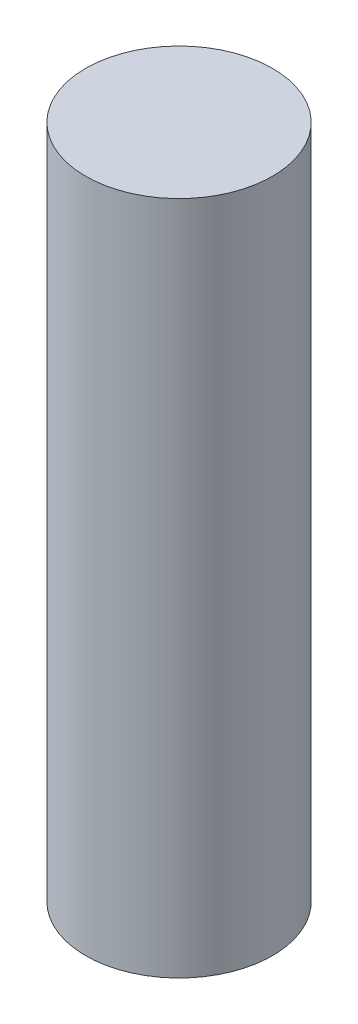
ISO-10303-21;
HEADER;
FILE_DESCRIPTION(('STEP AP214'),'2;1');
FILE_NAME('part.step','',(''),(''),'','','');
FILE_SCHEMA(('AUTOMOTIVE_DESIGN { 1 0 10303 214 1 1 1 1 }'));
ENDSEC;
DATA;
#1=APPLICATION_CONTEXT('core data for automotive mechanical design processes');
#2=APPLICATION_PROTOCOL_DEFINITION('international standard','automotive_design',2000,#1);
#3=PRODUCT_CONTEXT('',#1,'mechanical');
#4=PRODUCT('Part','Part','',(#3));
#5=PRODUCT_RELATED_PRODUCT_CATEGORY('part','',(#4));
#6=PRODUCT_DEFINITION_FORMATION('','',#4);
#7=PRODUCT_DEFINITION_CONTEXT('part definition',#1,'design');
#8=PRODUCT_DEFINITION('design','',#6,#7);
#9=PRODUCT_DEFINITION_SHAPE('','',#8);
#10=(LENGTH_UNIT() NAMED_UNIT(*) SI_UNIT(.MILLI.,.METRE.));
#11=(NAMED_UNIT(*) PLANE_ANGLE_UNIT() SI_UNIT($,.RADIAN.));
#12=(NAMED_UNIT(*) SI_UNIT($,.STERADIAN.) SOLID_ANGLE_UNIT());
#13=UNCERTAINTY_MEASURE_WITH_UNIT(LENGTH_MEASURE(1.E-05),#10,'distance_accuracy_value','');
#14=(GEOMETRIC_REPRESENTATION_CONTEXT(3) GLOBAL_UNCERTAINTY_ASSIGNED_CONTEXT((#13)) GLOBAL_UNIT_ASSIGNED_CONTEXT((#10,
#11,#12)) REPRESENTATION_CONTEXT('',''));
#15=CARTESIAN_POINT('',(0.,0.,0.));
#16=DIRECTION('',(0.,0.,1.));
#17=DIRECTION('',(1.,0.,0.));
#18=AXIS2_PLACEMENT_3D('',#15,#16,#17);
#19=CARTESIAN_POINT('',(0.,0.,0.));
#20=DIRECTION('',(0.,1.,0.));
#21=DIRECTION('',(-1.,0.,0.));
#22=AXIS2_PLACEMENT_3D('',#19,#20,#21);
#23=PLANE('',#22);
#24=CARTESIAN_POINT('',(0.,0.,0.));
#25=DIRECTION('',(0.,1.,0.));
#26=DIRECTION('',(-1.,0.,0.));
#27=AXIS2_PLACEMENT_3D('',#24,#25,#26);
#28=CIRCLE('',#27,9.);
#29=CARTESIAN_POINT('',(-9.,0.,0.));
#30=VERTEX_POINT('',#29);
#31=EDGE_CURVE('E10',#30,#30,#28,.T.);
#32=ORIENTED_EDGE('',*,*,#31,.F.);
#33=EDGE_LOOP('',(#32));
#34=FACE_BOUND('',#33,.T.);
#35=ADVANCED_FACE('F32',(#34),#23,.F.);
#36=CARTESIAN_POINT('',(0.,65.,0.));
#37=DIRECTION('',(0.,1.,0.));
#38=DIRECTION('',(-1.,0.,0.));
#39=AXIS2_PLACEMENT_3D('',#36,#37,#38);
#40=CYLINDRICAL_SURFACE('',#39,9.00000000000001);
#41=CARTESIAN_POINT('',(0.,65.,0.));
#42=DIRECTION('',(0.,1.,0.));
#43=DIRECTION('',(-1.,0.,0.));
#44=AXIS2_PLACEMENT_3D('',#41,#42,#43);
#45=CIRCLE('',#44,9.00000000000001);
#46=CARTESIAN_POINT('',(-9.00000000000001,65.,0.));
#47=VERTEX_POINT('',#46);
#48=EDGE_CURVE('E38',#47,#47,#45,.T.);
#49=ORIENTED_EDGE('',*,*,#48,.F.);
#50=EDGE_LOOP('',(#49));
#51=FACE_BOUND('',#50,.T.);
#52=ORIENTED_EDGE('',*,*,#31,.T.);
#53=EDGE_LOOP('',(#52));
#54=FACE_BOUND('',#53,.T.);
#55=ADVANCED_FACE('F46',(#51,#54),#40,.T.);
#56=CARTESIAN_POINT('',(9.00000000000001,65.,0.));
#57=DIRECTION('',(0.,-1.,0.));
#58=DIRECTION('',(1.,0.,0.));
#59=AXIS2_PLACEMENT_3D('',#56,#57,#58);
#60=PLANE('',#59);
#61=ORIENTED_EDGE('',*,*,#48,.T.);
#62=EDGE_LOOP('',(#61));
#63=FACE_BOUND('',#62,.T.);
#64=ADVANCED_FACE('F44',(#63),#60,.F.);
#65=CLOSED_SHELL('',(#35,#55,#64));
#66=MANIFOLD_SOLID_BREP('B2',#65);
#67=ADVANCED_BREP_SHAPE_REPRESENTATION('',(#18,#66),#14);
#68=SHAPE_DEFINITION_REPRESENTATION(#9,#67);
ENDSEC;
END-ISO-10303-21;
